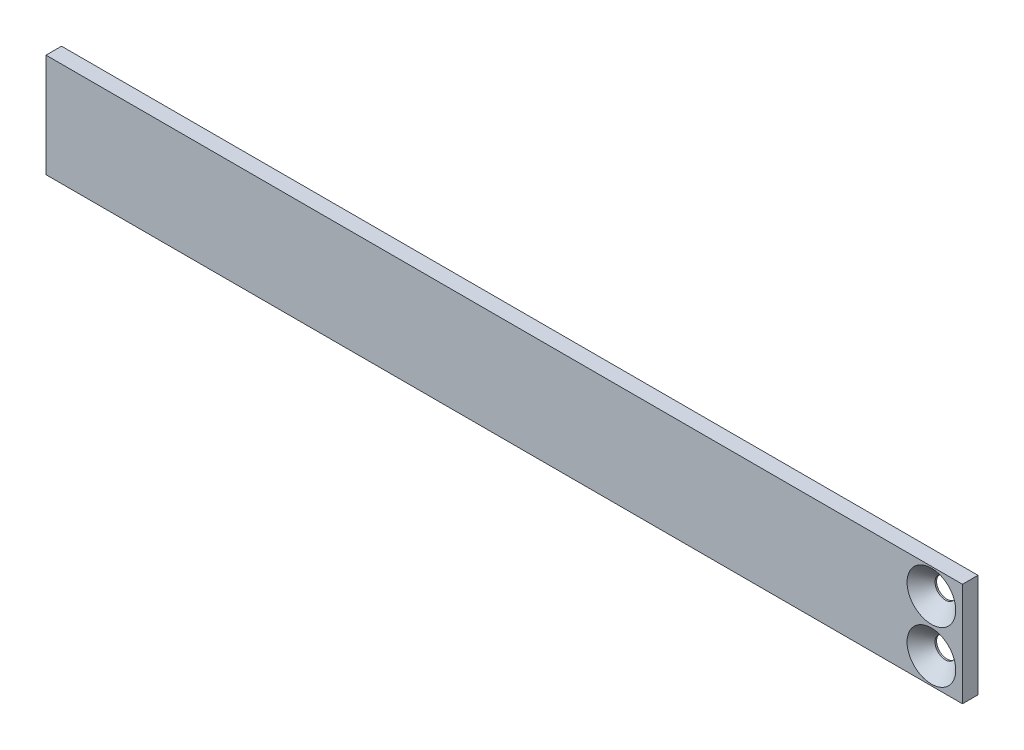
ISO-10303-21;
HEADER;
FILE_DESCRIPTION(('STEP AP214'),'2;1');
FILE_NAME('part.step','',(''),(''),'','','');
FILE_SCHEMA(('AUTOMOTIVE_DESIGN { 1 0 10303 214 1 1 1 1 }'));
ENDSEC;
DATA;
#1=APPLICATION_CONTEXT('core data for automotive mechanical design processes');
#2=APPLICATION_PROTOCOL_DEFINITION('international standard','automotive_design',2000,#1);
#3=PRODUCT_CONTEXT('',#1,'mechanical');
#4=PRODUCT('Part','Part','',(#3));
#5=PRODUCT_RELATED_PRODUCT_CATEGORY('part','',(#4));
#6=PRODUCT_DEFINITION_FORMATION('','',#4);
#7=PRODUCT_DEFINITION_CONTEXT('part definition',#1,'design');
#8=PRODUCT_DEFINITION('design','',#6,#7);
#9=PRODUCT_DEFINITION_SHAPE('','',#8);
#10=(LENGTH_UNIT() NAMED_UNIT(*) SI_UNIT(.MILLI.,.METRE.));
#11=(NAMED_UNIT(*) PLANE_ANGLE_UNIT() SI_UNIT($,.RADIAN.));
#12=(NAMED_UNIT(*) SI_UNIT($,.STERADIAN.) SOLID_ANGLE_UNIT());
#13=UNCERTAINTY_MEASURE_WITH_UNIT(LENGTH_MEASURE(1.E-05),#10,'distance_accuracy_value','');
#14=(GEOMETRIC_REPRESENTATION_CONTEXT(3) GLOBAL_UNCERTAINTY_ASSIGNED_CONTEXT((#13)) GLOBAL_UNIT_ASSIGNED_CONTEXT((#10,
#11,#12)) REPRESENTATION_CONTEXT('',''));
#15=CARTESIAN_POINT('',(0.,0.,0.));
#16=DIRECTION('',(0.,0.,1.));
#17=DIRECTION('',(1.,0.,0.));
#18=AXIS2_PLACEMENT_3D('',#15,#16,#17);
#19=CARTESIAN_POINT('',(0.,0.,3.));
#20=DIRECTION('',(1.,0.,0.));
#21=DIRECTION('',(0.,0.,-1.));
#22=AXIS2_PLACEMENT_3D('',#19,#20,#21);
#23=PLANE('',#22);
#24=DIRECTION('',(0.,-1.,0.));
#25=VECTOR('',#24,1.);
#26=CARTESIAN_POINT('',(0.,0.,0.));
#27=LINE('',#26,#25);
#28=CARTESIAN_POINT('',(0.,20.,0.));
#29=VERTEX_POINT('',#28);
#30=CARTESIAN_POINT('',(0.,0.,0.));
#31=VERTEX_POINT('',#30);
#32=EDGE_CURVE('E101',#29,#31,#27,.T.);
#33=ORIENTED_EDGE('',*,*,#32,.T.);
#34=DIRECTION('',(0.,0.,-1.));
#35=VECTOR('',#34,1.);
#36=CARTESIAN_POINT('',(0.,0.,3.));
#37=LINE('',#36,#35);
#38=CARTESIAN_POINT('',(0.,0.,3.));
#39=VERTEX_POINT('',#38);
#40=EDGE_CURVE('E92',#39,#31,#37,.T.);
#41=ORIENTED_EDGE('',*,*,#40,.F.);
#42=DIRECTION('',(0.,-1.,0.));
#43=VECTOR('',#42,1.);
#44=CARTESIAN_POINT('',(0.,0.,3.));
#45=LINE('',#44,#43);
#46=CARTESIAN_POINT('',(0.,20.,3.));
#47=VERTEX_POINT('',#46);
#48=EDGE_CURVE('E86',#47,#39,#45,.T.);
#49=ORIENTED_EDGE('',*,*,#48,.F.);
#50=DIRECTION('',(0.,0.,-1.));
#51=VECTOR('',#50,1.);
#52=CARTESIAN_POINT('',(0.,20.,3.));
#53=LINE('',#52,#51);
#54=EDGE_CURVE('E97',#47,#29,#53,.T.);
#55=ORIENTED_EDGE('',*,*,#54,.T.);
#56=EDGE_LOOP('',(#33,#41,#49,#55));
#57=FACE_BOUND('',#56,.T.);
#58=ADVANCED_FACE('F33',(#57),#23,.F.);
#59=CARTESIAN_POINT('',(0.,0.,3.));
#60=DIRECTION('',(0.,1.,0.));
#61=DIRECTION('',(0.,0.,1.));
#62=AXIS2_PLACEMENT_3D('',#59,#60,#61);
#63=PLANE('',#62);
#64=DIRECTION('',(1.,0.,0.));
#65=VECTOR('',#64,1.);
#66=CARTESIAN_POINT('',(0.,0.,0.));
#67=LINE('',#66,#65);
#68=CARTESIAN_POINT('',(177.,0.,0.));
#69=VERTEX_POINT('',#68);
#70=EDGE_CURVE('E91',#31,#69,#67,.T.);
#71=ORIENTED_EDGE('',*,*,#70,.T.);
#72=DIRECTION('',(0.,0.,-1.));
#73=VECTOR('',#72,1.);
#74=CARTESIAN_POINT('',(177.,0.,3.));
#75=LINE('',#74,#73);
#76=CARTESIAN_POINT('',(177.,0.,3.));
#77=VERTEX_POINT('',#76);
#78=EDGE_CURVE('E89',#77,#69,#75,.T.);
#79=ORIENTED_EDGE('',*,*,#78,.F.);
#80=DIRECTION('',(1.,0.,0.));
#81=VECTOR('',#80,1.);
#82=CARTESIAN_POINT('',(0.,0.,3.));
#83=LINE('',#82,#81);
#84=EDGE_CURVE('E81',#39,#77,#83,.T.);
#85=ORIENTED_EDGE('',*,*,#84,.F.);
#86=ORIENTED_EDGE('',*,*,#40,.T.);
#87=EDGE_LOOP('',(#71,#79,#85,#86));
#88=FACE_BOUND('',#87,.T.);
#89=ADVANCED_FACE('F90',(#88),#63,.F.);
#90=CARTESIAN_POINT('',(177.,0.,3.));
#91=DIRECTION('',(-1.,0.,0.));
#92=DIRECTION('',(0.,0.,1.));
#93=AXIS2_PLACEMENT_3D('',#90,#91,#92);
#94=PLANE('',#93);
#95=DIRECTION('',(0.,1.,0.));
#96=VECTOR('',#95,1.);
#97=CARTESIAN_POINT('',(177.,0.,0.));
#98=LINE('',#97,#96);
#99=CARTESIAN_POINT('',(177.,20.,0.));
#100=VERTEX_POINT('',#99);
#101=EDGE_CURVE('E67',#69,#100,#98,.T.);
#102=ORIENTED_EDGE('',*,*,#101,.T.);
#103=DIRECTION('',(0.,0.,-1.));
#104=VECTOR('',#103,1.);
#105=CARTESIAN_POINT('',(177.,20.,3.));
#106=LINE('',#105,#104);
#107=CARTESIAN_POINT('',(177.,20.,3.));
#108=VERTEX_POINT('',#107);
#109=EDGE_CURVE('E93',#108,#100,#106,.T.);
#110=ORIENTED_EDGE('',*,*,#109,.F.);
#111=DIRECTION('',(0.,1.,0.));
#112=VECTOR('',#111,1.);
#113=CARTESIAN_POINT('',(177.,0.,3.));
#114=LINE('',#113,#112);
#115=EDGE_CURVE('E84',#77,#108,#114,.T.);
#116=ORIENTED_EDGE('',*,*,#115,.F.);
#117=ORIENTED_EDGE('',*,*,#78,.T.);
#118=EDGE_LOOP('',(#102,#110,#116,#117));
#119=FACE_BOUND('',#118,.T.);
#120=ADVANCED_FACE('F95',(#119),#94,.F.);
#121=CARTESIAN_POINT('',(0.,20.,3.));
#122=DIRECTION('',(0.,-1.,0.));
#123=DIRECTION('',(0.,0.,-1.));
#124=AXIS2_PLACEMENT_3D('',#121,#122,#123);
#125=PLANE('',#124);
#126=DIRECTION('',(-1.,0.,0.));
#127=VECTOR('',#126,1.);
#128=CARTESIAN_POINT('',(0.,20.,0.));
#129=LINE('',#128,#127);
#130=EDGE_CURVE('E73',#100,#29,#129,.T.);
#131=ORIENTED_EDGE('',*,*,#130,.T.);
#132=ORIENTED_EDGE('',*,*,#54,.F.);
#133=DIRECTION('',(-1.,0.,0.));
#134=VECTOR('',#133,1.);
#135=CARTESIAN_POINT('',(0.,20.,3.));
#136=LINE('',#135,#134);
#137=EDGE_CURVE('E50',#108,#47,#136,.T.);
#138=ORIENTED_EDGE('',*,*,#137,.F.);
#139=ORIENTED_EDGE('',*,*,#109,.T.);
#140=EDGE_LOOP('',(#131,#132,#138,#139));
#141=FACE_BOUND('',#140,.T.);
#142=ADVANCED_FACE('F163',(#141),#125,.F.);
#143=CARTESIAN_POINT('',(0.,0.,3.));
#144=DIRECTION('',(0.,0.,-1.));
#145=DIRECTION('',(-1.,0.,0.));
#146=AXIS2_PLACEMENT_3D('',#143,#144,#145);
#147=PLANE('',#146);
#148=CARTESIAN_POINT('',(171.,15.,3.));
#149=DIRECTION('',(0.,0.,-1.));
#150=DIRECTION('',(-1.,0.,0.));
#151=AXIS2_PLACEMENT_3D('',#148,#149,#150);
#152=CIRCLE('',#151,4.69999999999995);
#153=CARTESIAN_POINT('',(166.3,15.,3.));
#154=VERTEX_POINT('',#153);
#155=EDGE_CURVE('E11',#154,#154,#152,.T.);
#156=ORIENTED_EDGE('',*,*,#155,.T.);
#157=EDGE_LOOP('',(#156));
#158=FACE_BOUND('',#157,.T.);
#159=CARTESIAN_POINT('',(171.,5.,3.));
#160=DIRECTION('',(0.,0.,-1.));
#161=DIRECTION('',(-1.,0.,0.));
#162=AXIS2_PLACEMENT_3D('',#159,#160,#161);
#163=CIRCLE('',#162,4.69999999999995);
#164=CARTESIAN_POINT('',(166.3,5.,3.));
#165=VERTEX_POINT('',#164);
#166=EDGE_CURVE('E117',#165,#165,#163,.T.);
#167=ORIENTED_EDGE('',*,*,#166,.T.);
#168=EDGE_LOOP('',(#167));
#169=FACE_BOUND('',#168,.T.);
#170=ORIENTED_EDGE('',*,*,#48,.T.);
#171=ORIENTED_EDGE('',*,*,#84,.T.);
#172=ORIENTED_EDGE('',*,*,#115,.T.);
#173=ORIENTED_EDGE('',*,*,#137,.T.);
#174=EDGE_LOOP('',(#170,#171,#172,#173));
#175=FACE_BOUND('',#174,.T.);
#176=ADVANCED_FACE('F82',(#158,#169,#175),#147,.F.);
#177=CARTESIAN_POINT('',(0.,0.,0.));
#178=DIRECTION('',(0.,0.,-1.));
#179=DIRECTION('',(-1.,0.,0.));
#180=AXIS2_PLACEMENT_3D('',#177,#178,#179);
#181=PLANE('',#180);
#182=CARTESIAN_POINT('',(171.,15.,0.));
#183=DIRECTION('',(0.,0.,-1.));
#184=DIRECTION('',(-1.,0.,0.));
#185=AXIS2_PLACEMENT_3D('',#182,#183,#184);
#186=CIRCLE('',#185,2.);
#187=CARTESIAN_POINT('',(169.,15.,0.));
#188=VERTEX_POINT('',#187);
#189=EDGE_CURVE('E114',#188,#188,#186,.T.);
#190=ORIENTED_EDGE('',*,*,#189,.F.);
#191=EDGE_LOOP('',(#190));
#192=FACE_BOUND('',#191,.T.);
#193=CARTESIAN_POINT('',(171.,5.,0.));
#194=DIRECTION('',(0.,0.,-1.));
#195=DIRECTION('',(-1.,0.,0.));
#196=AXIS2_PLACEMENT_3D('',#193,#194,#195);
#197=CIRCLE('',#196,2.);
#198=CARTESIAN_POINT('',(169.,5.,0.));
#199=VERTEX_POINT('',#198);
#200=EDGE_CURVE('E104',#199,#199,#197,.T.);
#201=ORIENTED_EDGE('',*,*,#200,.F.);
#202=EDGE_LOOP('',(#201));
#203=FACE_BOUND('',#202,.T.);
#204=ORIENTED_EDGE('',*,*,#32,.F.);
#205=ORIENTED_EDGE('',*,*,#130,.F.);
#206=ORIENTED_EDGE('',*,*,#101,.F.);
#207=ORIENTED_EDGE('',*,*,#70,.F.);
#208=EDGE_LOOP('',(#204,#205,#206,#207));
#209=FACE_BOUND('',#208,.T.);
#210=ADVANCED_FACE('F149',(#192,#203,#209),#181,.T.);
#211=CARTESIAN_POINT('',(171.,5.,-5.));
#212=DIRECTION('',(0.,0.,1.));
#213=DIRECTION('',(1.,0.,0.));
#214=AXIS2_PLACEMENT_3D('',#211,#212,#213);
#215=CYLINDRICAL_SURFACE('',#214,2.);
#216=CARTESIAN_POINT('',(171.,5.,0.300000000000062));
#217=DIRECTION('',(0.,0.,-1.));
#218=DIRECTION('',(-1.,0.,0.));
#219=AXIS2_PLACEMENT_3D('',#216,#217,#218);
#220=CIRCLE('',#219,2.);
#221=CARTESIAN_POINT('',(169.,5.,0.300000000000062));
#222=VERTEX_POINT('',#221);
#223=EDGE_CURVE('E111',#222,#222,#220,.F.);
#224=ORIENTED_EDGE('',*,*,#223,.T.);
#225=EDGE_LOOP('',(#224));
#226=FACE_BOUND('',#225,.T.);
#227=ORIENTED_EDGE('',*,*,#200,.T.);
#228=EDGE_LOOP('',(#227));
#229=FACE_BOUND('',#228,.T.);
#230=ADVANCED_FACE('F144',(#226,#229),#215,.F.);
#231=CARTESIAN_POINT('',(171.,5.,0.300000000000062));
#232=DIRECTION('',(0.,0.,1.));
#233=DIRECTION('',(1.,0.,0.));
#234=AXIS2_PLACEMENT_3D('',#231,#232,#233);
#235=CONICAL_SURFACE('',#234,2.,0.785398163397452);
#236=ORIENTED_EDGE('',*,*,#166,.F.);
#237=EDGE_LOOP('',(#236));
#238=FACE_BOUND('',#237,.T.);
#239=ORIENTED_EDGE('',*,*,#223,.F.);
#240=EDGE_LOOP('',(#239));
#241=FACE_BOUND('',#240,.T.);
#242=ADVANCED_FACE('F132',(#238,#241),#235,.F.);
#243=CARTESIAN_POINT('',(171.,15.,-5.));
#244=DIRECTION('',(0.,0.,1.));
#245=DIRECTION('',(1.,0.,0.));
#246=AXIS2_PLACEMENT_3D('',#243,#244,#245);
#247=CYLINDRICAL_SURFACE('',#246,2.);
#248=CARTESIAN_POINT('',(171.,15.,0.300000000000062));
#249=DIRECTION('',(0.,0.,-1.));
#250=DIRECTION('',(-1.,0.,0.));
#251=AXIS2_PLACEMENT_3D('',#248,#249,#250);
#252=CIRCLE('',#251,2.);
#253=CARTESIAN_POINT('',(169.,15.,0.300000000000062));
#254=VERTEX_POINT('',#253);
#255=EDGE_CURVE('E42',#254,#254,#252,.F.);
#256=ORIENTED_EDGE('',*,*,#255,.T.);
#257=EDGE_LOOP('',(#256));
#258=FACE_BOUND('',#257,.T.);
#259=ORIENTED_EDGE('',*,*,#189,.T.);
#260=EDGE_LOOP('',(#259));
#261=FACE_BOUND('',#260,.T.);
#262=ADVANCED_FACE('F124',(#258,#261),#247,.F.);
#263=CARTESIAN_POINT('',(171.,15.,0.300000000000062));
#264=DIRECTION('',(0.,0.,1.));
#265=DIRECTION('',(1.,0.,0.));
#266=AXIS2_PLACEMENT_3D('',#263,#264,#265);
#267=CONICAL_SURFACE('',#266,2.,0.785398163397452);
#268=ORIENTED_EDGE('',*,*,#155,.F.);
#269=EDGE_LOOP('',(#268));
#270=FACE_BOUND('',#269,.T.);
#271=ORIENTED_EDGE('',*,*,#255,.F.);
#272=EDGE_LOOP('',(#271));
#273=FACE_BOUND('',#272,.T.);
#274=ADVANCED_FACE('F35',(#270,#273),#267,.F.);
#275=CLOSED_SHELL('',(#58,#89,#120,#142,#176,#210,#230,#242,#262,#274));
#276=MANIFOLD_SOLID_BREP('B2',#275);
#277=ADVANCED_BREP_SHAPE_REPRESENTATION('',(#18,#276),#14);
#278=SHAPE_DEFINITION_REPRESENTATION(#9,#277);
ENDSEC;
END-ISO-10303-21;
